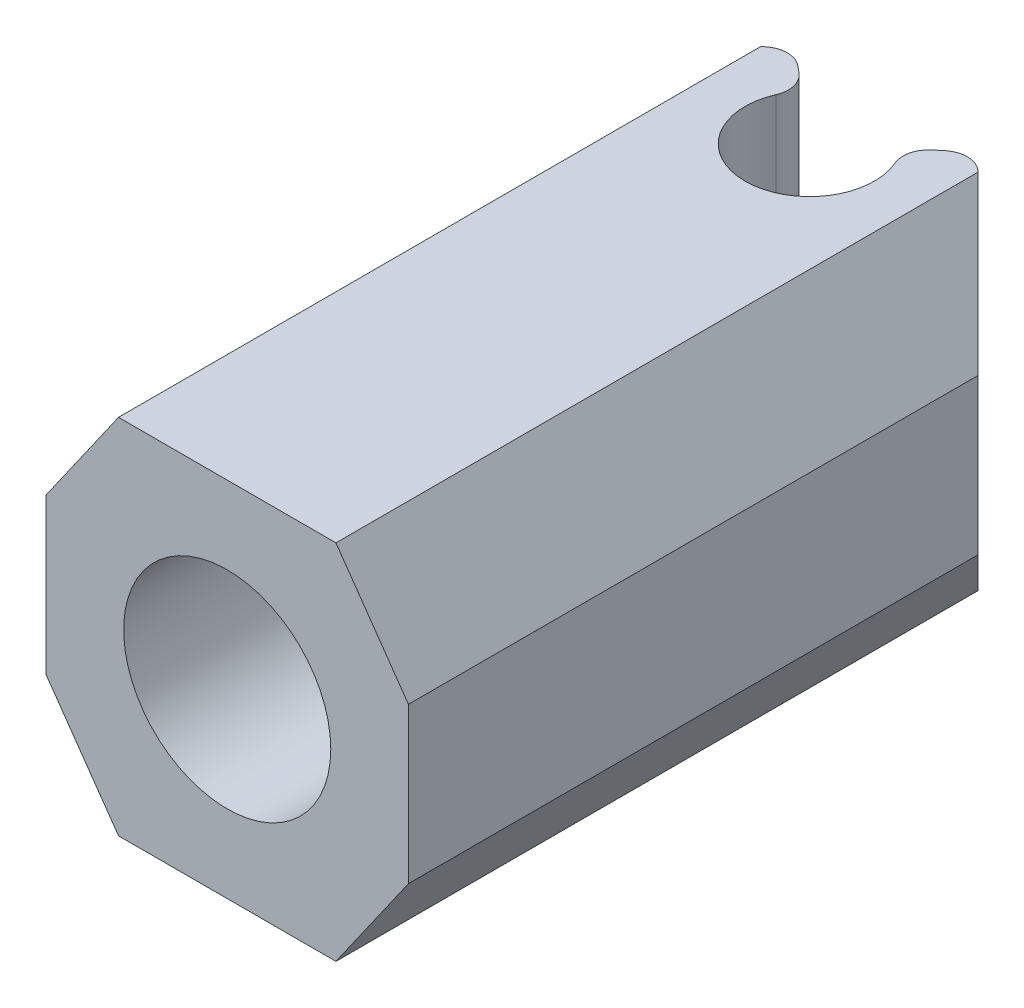
ISO-10303-21;
HEADER;
FILE_DESCRIPTION(('STEP AP214'),'2;1');
FILE_NAME('part.step','',(''),(''),'','','');
FILE_SCHEMA(('AUTOMOTIVE_DESIGN { 1 0 10303 214 1 1 1 1 }'));
ENDSEC;
DATA;
#1=APPLICATION_CONTEXT('core data for automotive mechanical design processes');
#2=APPLICATION_PROTOCOL_DEFINITION('international standard','automotive_design',2000,#1);
#3=PRODUCT_CONTEXT('',#1,'mechanical');
#4=PRODUCT('Part','Part','',(#3));
#5=PRODUCT_RELATED_PRODUCT_CATEGORY('part','',(#4));
#6=PRODUCT_DEFINITION_FORMATION('','',#4);
#7=PRODUCT_DEFINITION_CONTEXT('part definition',#1,'design');
#8=PRODUCT_DEFINITION('design','',#6,#7);
#9=PRODUCT_DEFINITION_SHAPE('','',#8);
#10=(LENGTH_UNIT() NAMED_UNIT(*) SI_UNIT(.MILLI.,.METRE.));
#11=(NAMED_UNIT(*) PLANE_ANGLE_UNIT() SI_UNIT($,.RADIAN.));
#12=(NAMED_UNIT(*) SI_UNIT($,.STERADIAN.) SOLID_ANGLE_UNIT());
#13=UNCERTAINTY_MEASURE_WITH_UNIT(LENGTH_MEASURE(1.E-05),#10,'distance_accuracy_value','');
#14=(GEOMETRIC_REPRESENTATION_CONTEXT(3) GLOBAL_UNCERTAINTY_ASSIGNED_CONTEXT((#13)) GLOBAL_UNIT_ASSIGNED_CONTEXT((#10,
#11,#12)) REPRESENTATION_CONTEXT('',''));
#15=CARTESIAN_POINT('',(0.,0.,0.));
#16=DIRECTION('',(0.,0.,1.));
#17=DIRECTION('',(1.,0.,0.));
#18=AXIS2_PLACEMENT_3D('',#15,#16,#17);
#19=CARTESIAN_POINT('',(0.,-3.,-15.));
#20=DIRECTION('',(0.,1.,0.));
#21=DIRECTION('',(0.,0.,1.));
#22=AXIS2_PLACEMENT_3D('',#19,#20,#21);
#23=PLANE('',#22);
#24=DIRECTION('',(-1.,0.,0.));
#25=VECTOR('',#24,1.);
#26=CARTESIAN_POINT('',(0.,-3.,-19.5));
#27=LINE('',#26,#25);
#28=CARTESIAN_POINT('',(0.343145750507606,-3.,-19.5));
#29=VERTEX_POINT('',#28);
#30=CARTESIAN_POINT('',(-0.343145750507613,-3.,-19.5));
#31=VERTEX_POINT('',#30);
#32=EDGE_CURVE('E251',#29,#31,#27,.T.);
#33=ORIENTED_EDGE('',*,*,#32,.T.);
#34=CARTESIAN_POINT('',(-0.343145750507613,-3.,-15.5));
#35=DIRECTION('',(0.,1.,0.));
#36=DIRECTION('',(0.,0.,1.));
#37=AXIS2_PLACEMENT_3D('',#34,#35,#36);
#38=CIRCLE('',#37,4.);
#39=CARTESIAN_POINT('',(-3.17157287525381,-3.,-18.3284271247462));
#40=VERTEX_POINT('',#39);
#41=EDGE_CURVE('E365',#31,#40,#38,.T.);
#42=ORIENTED_EDGE('',*,*,#41,.T.);
#43=DIRECTION('',(0.707106781186546,0.,-0.707106781186549));
#44=VECTOR('',#43,1.);
#45=CARTESIAN_POINT('',(-3.25,-3.,-18.25));
#46=LINE('',#45,#44);
#47=CARTESIAN_POINT('',(-6.49999999999998,-3.,-15.));
#48=VERTEX_POINT('',#47);
#49=EDGE_CURVE('E204',#40,#48,#46,.F.);
#50=ORIENTED_EDGE('',*,*,#49,.T.);
#51=DIRECTION('',(1.,0.,0.));
#52=VECTOR('',#51,1.);
#53=CARTESIAN_POINT('',(-7.,-3.,-15.));
#54=LINE('',#53,#52);
#55=CARTESIAN_POINT('',(-6.,-3.,-15.));
#56=VERTEX_POINT('',#55);
#57=EDGE_CURVE('E197',#48,#56,#54,.T.);
#58=ORIENTED_EDGE('',*,*,#57,.T.);
#59=CARTESIAN_POINT('',(0.,-3.,-15.));
#60=DIRECTION('',(0.,1.,0.));
#61=DIRECTION('',(0.,0.,1.));
#62=AXIS2_PLACEMENT_3D('',#59,#60,#61);
#63=CIRCLE('',#62,6.);
#64=CARTESIAN_POINT('',(6.,-3.,-15.));
#65=VERTEX_POINT('',#64);
#66=EDGE_CURVE('E203',#56,#65,#63,.T.);
#67=ORIENTED_EDGE('',*,*,#66,.T.);
#68=CARTESIAN_POINT('',(6.49999999999998,-3.,-15.));
#69=VERTEX_POINT('',#68);
#70=EDGE_CURVE('E208',#65,#69,#54,.T.);
#71=ORIENTED_EDGE('',*,*,#70,.T.);
#72=DIRECTION('',(0.707106781186546,0.,0.707106781186549));
#73=VECTOR('',#72,1.);
#74=CARTESIAN_POINT('',(3.25,-3.,-18.25));
#75=LINE('',#74,#73);
#76=CARTESIAN_POINT('',(3.1715728752538,-3.,-18.3284271247462));
#77=VERTEX_POINT('',#76);
#78=EDGE_CURVE('E274',#69,#77,#75,.F.);
#79=ORIENTED_EDGE('',*,*,#78,.T.);
#80=CARTESIAN_POINT('',(0.343145750507606,-3.,-15.5));
#81=DIRECTION('',(0.,1.,0.));
#82=DIRECTION('',(0.,0.,1.));
#83=AXIS2_PLACEMENT_3D('',#80,#81,#82);
#84=CIRCLE('',#83,4.);
#85=EDGE_CURVE('E363',#77,#29,#84,.T.);
#86=ORIENTED_EDGE('',*,*,#85,.T.);
#87=EDGE_LOOP('',(#33,#42,#50,#58,#67,#71,#79,#86));
#88=FACE_BOUND('',#87,.T.);
#89=CARTESIAN_POINT('',(0.,-3.,-15.));
#90=DIRECTION('',(0.,1.,0.));
#91=DIRECTION('',(0.,0.,1.));
#92=AXIS2_PLACEMENT_3D('',#89,#90,#91);
#93=CIRCLE('',#92,3.5);
#94=CARTESIAN_POINT('',(0.,-3.,-11.5));
#95=VERTEX_POINT('',#94);
#96=EDGE_CURVE('E407',#95,#95,#93,.T.);
#97=ORIENTED_EDGE('',*,*,#96,.F.);
#98=EDGE_LOOP('',(#97));
#99=FACE_BOUND('',#98,.T.);
#100=ADVANCED_FACE('F35',(#88,#99),#23,.T.);
#101=CARTESIAN_POINT('',(0.,0.,-19.5));
#102=DIRECTION('',(0.,0.,1.));
#103=DIRECTION('',(1.,0.,0.));
#104=AXIS2_PLACEMENT_3D('',#101,#102,#103);
#105=PLANE('',#104);
#106=DIRECTION('',(-1.,0.,0.));
#107=VECTOR('',#106,1.);
#108=CARTESIAN_POINT('',(7.,-7.,-19.5));
#109=LINE('',#108,#107);
#110=CARTESIAN_POINT('',(0.343145750507605,-7.,-19.5));
#111=VERTEX_POINT('',#110);
#112=CARTESIAN_POINT('',(-0.343145750507613,-7.,-19.5));
#113=VERTEX_POINT('',#112);
#114=EDGE_CURVE('E222',#111,#113,#109,.T.);
#115=ORIENTED_EDGE('',*,*,#114,.T.);
#116=DIRECTION('',(0.,-1.,0.));
#117=VECTOR('',#116,1.);
#118=CARTESIAN_POINT('',(-0.343145750507613,-3.,-19.5));
#119=LINE('',#118,#117);
#120=EDGE_CURVE('E360',#113,#31,#119,.F.);
#121=ORIENTED_EDGE('',*,*,#120,.T.);
#122=ORIENTED_EDGE('',*,*,#32,.F.);
#123=DIRECTION('',(0.,1.,0.));
#124=VECTOR('',#123,1.);
#125=CARTESIAN_POINT('',(0.343145750507606,-7.,-19.5));
#126=LINE('',#125,#124);
#127=EDGE_CURVE('E357',#29,#111,#126,.F.);
#128=ORIENTED_EDGE('',*,*,#127,.T.);
#129=EDGE_LOOP('',(#115,#121,#122,#128));
#130=FACE_BOUND('',#129,.T.);
#131=ADVANCED_FACE('F373',(#130),#105,.F.);
#132=CARTESIAN_POINT('',(-7.,7.,-7.49999999999999));
#133=DIRECTION('',(1.,0.,0.));
#134=DIRECTION('',(0.,0.,-1.));
#135=AXIS2_PLACEMENT_3D('',#132,#133,#134);
#136=PLANE('',#135);
#137=DIRECTION('',(0.,-1.,0.));
#138=VECTOR('',#137,1.);
#139=CARTESIAN_POINT('',(-7.,7.,-14.5));
#140=LINE('',#139,#138);
#141=CARTESIAN_POINT('',(-7.,2.99999999999998,-14.5));
#142=VERTEX_POINT('',#141);
#143=CARTESIAN_POINT('',(-7.,-2.99999999999998,-14.5));
#144=VERTEX_POINT('',#143);
#145=EDGE_CURVE('E279',#142,#144,#140,.T.);
#146=ORIENTED_EDGE('',*,*,#145,.T.);
#147=DIRECTION('',(0.,0.,1.));
#148=VECTOR('',#147,1.);
#149=CARTESIAN_POINT('',(-7.,-2.99999999999998,7.50000000000001));
#150=LINE('',#149,#148);
#151=CARTESIAN_POINT('',(-7.,-2.99999999999998,7.50000000000001));
#152=VERTEX_POINT('',#151);
#153=EDGE_CURVE('E316',#144,#152,#150,.T.);
#154=ORIENTED_EDGE('',*,*,#153,.T.);
#155=DIRECTION('',(0.,-1.,0.));
#156=VECTOR('',#155,1.);
#157=CARTESIAN_POINT('',(-7.,7.,7.50000000000001));
#158=LINE('',#157,#156);
#159=CARTESIAN_POINT('',(-7.,2.99999999999998,7.50000000000001));
#160=VERTEX_POINT('',#159);
#161=EDGE_CURVE('E248',#160,#152,#158,.T.);
#162=ORIENTED_EDGE('',*,*,#161,.F.);
#163=DIRECTION('',(0.,0.,-1.));
#164=VECTOR('',#163,1.);
#165=CARTESIAN_POINT('',(-7.,2.99999999999998,-7.49999999999999));
#166=LINE('',#165,#164);
#167=EDGE_CURVE('E297',#160,#142,#166,.T.);
#168=ORIENTED_EDGE('',*,*,#167,.T.);
#169=EDGE_LOOP('',(#146,#154,#162,#168));
#170=FACE_BOUND('',#169,.T.);
#171=ADVANCED_FACE('F432',(#170),#136,.F.);
#172=CARTESIAN_POINT('',(7.,7.,7.5));
#173=DIRECTION('',(0.,0.,-1.));
#174=DIRECTION('',(-1.,0.,0.));
#175=AXIS2_PLACEMENT_3D('',#172,#173,#174);
#176=PLANE('',#175);
#177=CARTESIAN_POINT('',(0.,0.,7.5));
#178=DIRECTION('',(0.,0.,1.));
#179=DIRECTION('',(1.,0.,0.));
#180=AXIS2_PLACEMENT_3D('',#177,#178,#179);
#181=CIRCLE('',#180,4.);
#182=CARTESIAN_POINT('',(4.,0.,7.5));
#183=VERTEX_POINT('',#182);
#184=EDGE_CURVE('E226',#183,#183,#181,.T.);
#185=ORIENTED_EDGE('',*,*,#184,.F.);
#186=EDGE_LOOP('',(#185));
#187=FACE_BOUND('',#186,.T.);
#188=DIRECTION('',(1.,0.,0.));
#189=VECTOR('',#188,1.);
#190=CARTESIAN_POINT('',(7.,-7.,7.5));
#191=LINE('',#190,#189);
#192=CARTESIAN_POINT('',(-4.19916984716116,-7.,7.50000000000001));
#193=VERTEX_POINT('',#192);
#194=CARTESIAN_POINT('',(4.19916984716116,-7.,7.5));
#195=VERTEX_POINT('',#194);
#196=EDGE_CURVE('E237',#193,#195,#191,.T.);
#197=ORIENTED_EDGE('',*,*,#196,.T.);
#198=DIRECTION('',(0.573576436351045,0.819152044288993,0.));
#199=VECTOR('',#198,1.);
#200=CARTESIAN_POINT('',(7.,-2.99999999999999,7.5));
#201=LINE('',#200,#199);
#202=CARTESIAN_POINT('',(7.,-2.99999999999999,7.5));
#203=VERTEX_POINT('',#202);
#204=EDGE_CURVE('E314',#195,#203,#201,.T.);
#205=ORIENTED_EDGE('',*,*,#204,.T.);
#206=DIRECTION('',(0.,-1.,0.));
#207=VECTOR('',#206,1.);
#208=CARTESIAN_POINT('',(7.,7.,7.5));
#209=LINE('',#208,#207);
#210=CARTESIAN_POINT('',(7.,2.99999999999998,7.5));
#211=VERTEX_POINT('',#210);
#212=EDGE_CURVE('E243',#211,#203,#209,.T.);
#213=ORIENTED_EDGE('',*,*,#212,.F.);
#214=DIRECTION('',(0.573576436351045,-0.819152044288993,0.));
#215=VECTOR('',#214,1.);
#216=CARTESIAN_POINT('',(4.19916984716116,7.,7.5));
#217=LINE('',#216,#215);
#218=CARTESIAN_POINT('',(4.19916984716116,7.,7.5));
#219=VERTEX_POINT('',#218);
#220=EDGE_CURVE('E295',#211,#219,#217,.F.);
#221=ORIENTED_EDGE('',*,*,#220,.T.);
#222=DIRECTION('',(1.,0.,0.));
#223=VECTOR('',#222,1.);
#224=CARTESIAN_POINT('',(7.,7.,7.5));
#225=LINE('',#224,#223);
#226=CARTESIAN_POINT('',(-4.19916984716116,7.,7.50000000000001));
#227=VERTEX_POINT('',#226);
#228=EDGE_CURVE('E240',#227,#219,#225,.T.);
#229=ORIENTED_EDGE('',*,*,#228,.F.);
#230=DIRECTION('',(0.573576436351044,0.819152044288993,0.));
#231=VECTOR('',#230,1.);
#232=CARTESIAN_POINT('',(-4.19916984716116,7.,7.50000000000001));
#233=LINE('',#232,#231);
#234=EDGE_CURVE('E293',#227,#160,#233,.F.);
#235=ORIENTED_EDGE('',*,*,#234,.T.);
#236=ORIENTED_EDGE('',*,*,#161,.T.);
#237=DIRECTION('',(0.573576436351045,-0.819152044288993,0.));
#238=VECTOR('',#237,1.);
#239=CARTESIAN_POINT('',(-7.,-2.99999999999998,7.50000000000001));
#240=LINE('',#239,#238);
#241=EDGE_CURVE('E312',#152,#193,#240,.T.);
#242=ORIENTED_EDGE('',*,*,#241,.T.);
#243=EDGE_LOOP('',(#197,#205,#213,#221,#229,#235,#236,#242));
#244=FACE_BOUND('',#243,.T.);
#245=ADVANCED_FACE('F457',(#187,#244),#176,.F.);
#246=CARTESIAN_POINT('',(7.,7.,-7.5));
#247=DIRECTION('',(-1.,0.,0.));
#248=DIRECTION('',(0.,0.,1.));
#249=AXIS2_PLACEMENT_3D('',#246,#247,#248);
#250=PLANE('',#249);
#251=ORIENTED_EDGE('',*,*,#212,.T.);
#252=DIRECTION('',(0.,0.,-1.));
#253=VECTOR('',#252,1.);
#254=CARTESIAN_POINT('',(7.,-2.99999999999999,-14.5));
#255=LINE('',#254,#253);
#256=CARTESIAN_POINT('',(7.,-2.99999999999999,-14.5));
#257=VERTEX_POINT('',#256);
#258=EDGE_CURVE('E302',#203,#257,#255,.T.);
#259=ORIENTED_EDGE('',*,*,#258,.T.);
#260=DIRECTION('',(0.,1.,0.));
#261=VECTOR('',#260,1.);
#262=CARTESIAN_POINT('',(7.,7.,-14.5));
#263=LINE('',#262,#261);
#264=CARTESIAN_POINT('',(7.,2.99999999999998,-14.5));
#265=VERTEX_POINT('',#264);
#266=EDGE_CURVE('E259',#257,#265,#263,.T.);
#267=ORIENTED_EDGE('',*,*,#266,.T.);
#268=DIRECTION('',(0.,0.,1.));
#269=VECTOR('',#268,1.);
#270=CARTESIAN_POINT('',(7.,2.99999999999998,-7.5));
#271=LINE('',#270,#269);
#272=EDGE_CURVE('E291',#265,#211,#271,.T.);
#273=ORIENTED_EDGE('',*,*,#272,.T.);
#274=EDGE_LOOP('',(#251,#259,#267,#273));
#275=FACE_BOUND('',#274,.T.);
#276=ADVANCED_FACE('F451',(#275),#250,.F.);
#277=CARTESIAN_POINT('',(0.,7.,0.));
#278=DIRECTION('',(0.,-1.,0.));
#279=DIRECTION('',(0.,0.,-1.));
#280=AXIS2_PLACEMENT_3D('',#277,#278,#279);
#281=PLANE('',#280);
#282=DIRECTION('',(0.766044443118979,0.,0.642787609686538));
#283=VECTOR('',#282,1.);
#284=CARTESIAN_POINT('',(-11.7512907121979,7.,-24.8605037024622));
#285=LINE('',#284,#283);
#286=CARTESIAN_POINT('',(-2.83238775254652,7.,-17.3766555185128));
#287=VERTEX_POINT('',#286);
#288=CARTESIAN_POINT('',(-2.56939117290001,7.,-17.1559751855305));
#289=VERTEX_POINT('',#288);
#290=EDGE_CURVE('E547',#287,#289,#285,.T.);
#291=ORIENTED_EDGE('',*,*,#290,.F.);
#292=CARTESIAN_POINT('',(-3.47517536223306,7.,-16.6106110753938));
#293=DIRECTION('',(0.,-1.,0.));
#294=DIRECTION('',(0.,0.,-1.));
#295=AXIS2_PLACEMENT_3D('',#292,#293,#294);
#296=CIRCLE('',#295,1.);
#297=CARTESIAN_POINT('',(-4.1822821434196,7.,-17.3177178565804));
#298=VERTEX_POINT('',#297);
#299=EDGE_CURVE('E332',#287,#298,#296,.F.);
#300=ORIENTED_EDGE('',*,*,#299,.T.);
#301=DIRECTION('',(0.707106781186546,0.,-0.707106781186549));
#302=VECTOR('',#301,1.);
#303=CARTESIAN_POINT('',(-2.,7.,-19.5));
#304=LINE('',#303,#302);
#305=CARTESIAN_POINT('',(-4.19916984716116,7.,-17.3008301528388));
#306=VERTEX_POINT('',#305);
#307=EDGE_CURVE('E261',#298,#306,#304,.F.);
#308=ORIENTED_EDGE('',*,*,#307,.T.);
#309=DIRECTION('',(0.,0.,1.));
#310=VECTOR('',#309,1.);
#311=CARTESIAN_POINT('',(-4.19916984716116,7.,0.));
#312=LINE('',#311,#310);
#313=EDGE_CURVE('E282',#306,#227,#312,.T.);
#314=ORIENTED_EDGE('',*,*,#313,.T.);
#315=ORIENTED_EDGE('',*,*,#228,.T.);
#316=DIRECTION('',(0.,0.,-1.));
#317=VECTOR('',#316,1.);
#318=CARTESIAN_POINT('',(4.19916984716116,7.,0.));
#319=LINE('',#318,#317);
#320=CARTESIAN_POINT('',(4.19916984716116,7.,-17.3008301528388));
#321=VERTEX_POINT('',#320);
#322=EDGE_CURVE('E285',#219,#321,#319,.T.);
#323=ORIENTED_EDGE('',*,*,#322,.T.);
#324=DIRECTION('',(0.707106781186546,0.,0.707106781186549));
#325=VECTOR('',#324,1.);
#326=CARTESIAN_POINT('',(1.99999999999999,7.,-19.5));
#327=LINE('',#326,#325);
#328=CARTESIAN_POINT('',(4.1822821434196,7.,-17.3177178565804));
#329=VERTEX_POINT('',#328);
#330=EDGE_CURVE('E263',#321,#329,#327,.F.);
#331=ORIENTED_EDGE('',*,*,#330,.T.);
#332=CARTESIAN_POINT('',(3.47517536223306,7.,-16.6106110753938));
#333=DIRECTION('',(0.,-1.,0.));
#334=DIRECTION('',(0.,0.,-1.));
#335=AXIS2_PLACEMENT_3D('',#332,#333,#334);
#336=CIRCLE('',#335,1.);
#337=CARTESIAN_POINT('',(2.83238775254652,7.,-17.3766555185128));
#338=VERTEX_POINT('',#337);
#339=EDGE_CURVE('E330',#329,#338,#336,.F.);
#340=ORIENTED_EDGE('',*,*,#339,.T.);
#341=DIRECTION('',(0.766044443118979,0.,-0.642787609686538));
#342=VECTOR('',#341,1.);
#343=CARTESIAN_POINT('',(0.,7.,-15.));
#344=LINE('',#343,#342);
#345=CARTESIAN_POINT('',(2.56939117290001,7.,-17.1559751855305));
#346=VERTEX_POINT('',#345);
#347=EDGE_CURVE('E545',#346,#338,#344,.T.);
#348=ORIENTED_EDGE('',*,*,#347,.F.);
#349=CARTESIAN_POINT('',(3.21217878258655,7.,-16.3899307424116));
#350=DIRECTION('',(0.,-1.,0.));
#351=DIRECTION('',(0.,0.,-1.));
#352=AXIS2_PLACEMENT_3D('',#349,#350,#351);
#353=CIRCLE('',#352,1.);
#354=CARTESIAN_POINT('',(2.29441341613325,7.,-15.9928076731511));
#355=VERTEX_POINT('',#354);
#356=EDGE_CURVE('E326',#346,#355,#353,.F.);
#357=ORIENTED_EDGE('',*,*,#356,.T.);
#358=CARTESIAN_POINT('',(0.,7.,-15.));
#359=DIRECTION('',(0.,1.,0.));
#360=DIRECTION('',(0.,0.,1.));
#361=AXIS2_PLACEMENT_3D('',#358,#359,#360);
#362=CIRCLE('',#361,2.5);
#363=CARTESIAN_POINT('',(-2.29441341613325,7.,-15.9928076731511));
#364=VERTEX_POINT('',#363);
#365=EDGE_CURVE('E388',#364,#355,#362,.T.);
#366=ORIENTED_EDGE('',*,*,#365,.F.);
#367=CARTESIAN_POINT('',(-3.21217878258655,7.,-16.3899307424116));
#368=DIRECTION('',(0.,-1.,0.));
#369=DIRECTION('',(0.,0.,-1.));
#370=AXIS2_PLACEMENT_3D('',#367,#368,#369);
#371=CIRCLE('',#370,1.);
#372=EDGE_CURVE('E328',#364,#289,#371,.F.);
#373=ORIENTED_EDGE('',*,*,#372,.T.);
#374=EDGE_LOOP('',(#291,#300,#308,#314,#315,#323,#331,#340,#348,#357,#366,#373));
#375=FACE_BOUND('',#374,.T.);
#376=ADVANCED_FACE('F448',(#375),#281,.F.);
#377=CARTESIAN_POINT('',(0.,-7.,0.));
#378=DIRECTION('',(0.,-1.,0.));
#379=DIRECTION('',(0.,0.,-1.));
#380=AXIS2_PLACEMENT_3D('',#377,#378,#379);
#381=PLANE('',#380);
#382=CARTESIAN_POINT('',(0.,-7.,-15.));
#383=DIRECTION('',(0.,1.,0.));
#384=DIRECTION('',(0.,0.,1.));
#385=AXIS2_PLACEMENT_3D('',#382,#383,#384);
#386=CIRCLE('',#385,2.5);
#387=CARTESIAN_POINT('',(0.,-7.,-12.5));
#388=VERTEX_POINT('',#387);
#389=EDGE_CURVE('E231',#388,#388,#386,.T.);
#390=ORIENTED_EDGE('',*,*,#389,.T.);
#391=EDGE_LOOP('',(#390));
#392=FACE_BOUND('',#391,.T.);
#393=DIRECTION('',(-0.707106781186546,0.,0.707106781186549));
#394=VECTOR('',#393,1.);
#395=CARTESIAN_POINT('',(-10.75,-7.,-10.75));
#396=LINE('',#395,#394);
#397=CARTESIAN_POINT('',(-4.19916984716116,-7.,-17.3008301528388));
#398=VERTEX_POINT('',#397);
#399=CARTESIAN_POINT('',(-3.17157287525381,-7.,-18.3284271247462));
#400=VERTEX_POINT('',#399);
#401=EDGE_CURVE('E253',#398,#400,#396,.F.);
#402=ORIENTED_EDGE('',*,*,#401,.T.);
#403=CARTESIAN_POINT('',(-0.343145750507613,-7.,-15.5));
#404=DIRECTION('',(0.,-1.,0.));
#405=DIRECTION('',(0.,0.,-1.));
#406=AXIS2_PLACEMENT_3D('',#403,#404,#405);
#407=CIRCLE('',#406,4.);
#408=EDGE_CURVE('E43',#400,#113,#407,.T.);
#409=ORIENTED_EDGE('',*,*,#408,.T.);
#410=ORIENTED_EDGE('',*,*,#114,.F.);
#411=CARTESIAN_POINT('',(0.343145750507606,-7.,-15.5));
#412=DIRECTION('',(0.,-1.,0.));
#413=DIRECTION('',(0.,0.,-1.));
#414=AXIS2_PLACEMENT_3D('',#411,#412,#413);
#415=CIRCLE('',#414,4.);
#416=CARTESIAN_POINT('',(3.1715728752538,-7.,-18.3284271247462));
#417=VERTEX_POINT('',#416);
#418=EDGE_CURVE('E50',#111,#417,#415,.T.);
#419=ORIENTED_EDGE('',*,*,#418,.T.);
#420=DIRECTION('',(-0.707106781186546,0.,-0.707106781186549));
#421=VECTOR('',#420,1.);
#422=CARTESIAN_POINT('',(10.75,-7.,-10.75));
#423=LINE('',#422,#421);
#424=CARTESIAN_POINT('',(4.19916984716115,-7.,-17.3008301528388));
#425=VERTEX_POINT('',#424);
#426=EDGE_CURVE('E257',#417,#425,#423,.F.);
#427=ORIENTED_EDGE('',*,*,#426,.T.);
#428=DIRECTION('',(0.,0.,1.));
#429=VECTOR('',#428,1.);
#430=CARTESIAN_POINT('',(4.19916984716116,-7.,7.5));
#431=LINE('',#430,#429);
#432=EDGE_CURVE('E310',#425,#195,#431,.T.);
#433=ORIENTED_EDGE('',*,*,#432,.T.);
#434=ORIENTED_EDGE('',*,*,#196,.F.);
#435=DIRECTION('',(0.,0.,-1.));
#436=VECTOR('',#435,1.);
#437=CARTESIAN_POINT('',(-4.19916984716116,-7.,-14.5));
#438=LINE('',#437,#436);
#439=EDGE_CURVE('E308',#193,#398,#438,.T.);
#440=ORIENTED_EDGE('',*,*,#439,.T.);
#441=EDGE_LOOP('',(#402,#409,#410,#419,#427,#433,#434,#440));
#442=FACE_BOUND('',#441,.T.);
#443=ADVANCED_FACE('F369',(#392,#442),#381,.T.);
#444=CARTESIAN_POINT('',(0.,0.,-7.5));
#445=DIRECTION('',(0.,0.,1.));
#446=DIRECTION('',(1.,0.,0.));
#447=AXIS2_PLACEMENT_3D('',#444,#445,#446);
#448=CYLINDRICAL_SURFACE('',#447,4.);
#449=CARTESIAN_POINT('',(0.,0.,-7.5));
#450=DIRECTION('',(0.,0.,1.));
#451=DIRECTION('',(1.,0.,0.));
#452=AXIS2_PLACEMENT_3D('',#449,#450,#451);
#453=CIRCLE('',#452,4.);
#454=CARTESIAN_POINT('',(4.,0.,-7.5));
#455=VERTEX_POINT('',#454);
#456=EDGE_CURVE('E234',#455,#455,#453,.T.);
#457=ORIENTED_EDGE('',*,*,#456,.F.);
#458=EDGE_LOOP('',(#457));
#459=FACE_BOUND('',#458,.T.);
#460=ORIENTED_EDGE('',*,*,#184,.T.);
#461=EDGE_LOOP('',(#460));
#462=FACE_BOUND('',#461,.T.);
#463=ADVANCED_FACE('F443',(#459,#462),#448,.F.);
#464=CARTESIAN_POINT('',(0.,0.,-7.49999999999999));
#465=DIRECTION('',(0.,0.,1.));
#466=DIRECTION('',(1.,0.,0.));
#467=AXIS2_PLACEMENT_3D('',#464,#465,#466);
#468=PLANE('',#467);
#469=ORIENTED_EDGE('',*,*,#456,.T.);
#470=EDGE_LOOP('',(#469));
#471=FACE_BOUND('',#470,.T.);
#472=ADVANCED_FACE('F439',(#471),#468,.T.);
#473=CARTESIAN_POINT('',(0.,-3.,-15.));
#474=DIRECTION('',(0.,1.,0.));
#475=DIRECTION('',(0.,0.,1.));
#476=AXIS2_PLACEMENT_3D('',#473,#474,#475);
#477=CYLINDRICAL_SURFACE('',#476,6.);
#478=CARTESIAN_POINT('',(0.,3.,-15.));
#479=DIRECTION('',(0.,1.,0.));
#480=DIRECTION('',(0.,0.,1.));
#481=AXIS2_PLACEMENT_3D('',#478,#479,#480);
#482=CIRCLE('',#481,6.);
#483=CARTESIAN_POINT('',(-6.,3.,-15.));
#484=VERTEX_POINT('',#483);
#485=CARTESIAN_POINT('',(6.,3.,-15.));
#486=VERTEX_POINT('',#485);
#487=EDGE_CURVE('E223',#484,#486,#482,.T.);
#488=ORIENTED_EDGE('',*,*,#487,.T.);
#489=DIRECTION('',(0.,1.,0.));
#490=VECTOR('',#489,1.);
#491=CARTESIAN_POINT('',(6.,-3.,-15.));
#492=LINE('',#491,#490);
#493=EDGE_CURVE('E217',#486,#65,#492,.F.);
#494=ORIENTED_EDGE('',*,*,#493,.T.);
#495=ORIENTED_EDGE('',*,*,#66,.F.);
#496=DIRECTION('',(0.,1.,0.));
#497=VECTOR('',#496,1.);
#498=CARTESIAN_POINT('',(-6.,-3.,-15.));
#499=LINE('',#498,#497);
#500=EDGE_CURVE('E207',#56,#484,#499,.T.);
#501=ORIENTED_EDGE('',*,*,#500,.T.);
#502=EDGE_LOOP('',(#488,#494,#495,#501));
#503=FACE_BOUND('',#502,.T.);
#504=ADVANCED_FACE('F220',(#503),#477,.F.);
#505=CARTESIAN_POINT('',(0.,3.,-15.));
#506=DIRECTION('',(0.,1.,0.));
#507=DIRECTION('',(0.,0.,1.));
#508=AXIS2_PLACEMENT_3D('',#505,#506,#507);
#509=PLANE('',#508);
#510=DIRECTION('',(-0.707106781186546,0.,0.707106781186549));
#511=VECTOR('',#510,1.);
#512=CARTESIAN_POINT('',(-2.,3.,-19.5));
#513=LINE('',#512,#511);
#514=CARTESIAN_POINT('',(-6.49999999999998,3.,-15.));
#515=VERTEX_POINT('',#514);
#516=CARTESIAN_POINT('',(-4.1822821434196,3.,-17.3177178565804));
#517=VERTEX_POINT('',#516);
#518=EDGE_CURVE('E266',#515,#517,#513,.F.);
#519=ORIENTED_EDGE('',*,*,#518,.T.);
#520=CARTESIAN_POINT('',(-3.47517536223306,3.,-16.6106110753938));
#521=DIRECTION('',(0.,1.,0.));
#522=DIRECTION('',(0.,0.,1.));
#523=AXIS2_PLACEMENT_3D('',#520,#521,#522);
#524=CIRCLE('',#523,1.);
#525=CARTESIAN_POINT('',(-2.83238775254652,3.,-17.3766555185128));
#526=VERTEX_POINT('',#525);
#527=EDGE_CURVE('E342',#517,#526,#524,.F.);
#528=ORIENTED_EDGE('',*,*,#527,.T.);
#529=DIRECTION('',(0.766044443118979,0.,0.642787609686538));
#530=VECTOR('',#529,1.);
#531=CARTESIAN_POINT('',(0.,3.,-15.));
#532=LINE('',#531,#530);
#533=CARTESIAN_POINT('',(-2.56939117290001,3.,-17.1559751855305));
#534=VERTEX_POINT('',#533);
#535=EDGE_CURVE('E412',#526,#534,#532,.T.);
#536=ORIENTED_EDGE('',*,*,#535,.T.);
#537=CARTESIAN_POINT('',(-3.21217878258655,3.,-16.3899307424116));
#538=DIRECTION('',(0.,1.,0.));
#539=DIRECTION('',(0.,0.,1.));
#540=AXIS2_PLACEMENT_3D('',#537,#538,#539);
#541=CIRCLE('',#540,1.);
#542=CARTESIAN_POINT('',(-2.29441341613325,3.,-15.9928076731511));
#543=VERTEX_POINT('',#542);
#544=EDGE_CURVE('E338',#534,#543,#541,.F.);
#545=ORIENTED_EDGE('',*,*,#544,.T.);
#546=CARTESIAN_POINT('',(0.,3.,-15.));
#547=DIRECTION('',(0.,1.,0.));
#548=DIRECTION('',(0.,0.,1.));
#549=AXIS2_PLACEMENT_3D('',#546,#547,#548);
#550=CIRCLE('',#549,2.5);
#551=CARTESIAN_POINT('',(2.29441341613325,3.,-15.9928076731511));
#552=VERTEX_POINT('',#551);
#553=EDGE_CURVE('E228',#543,#552,#550,.T.);
#554=ORIENTED_EDGE('',*,*,#553,.T.);
#555=CARTESIAN_POINT('',(3.21217878258655,3.,-16.3899307424116));
#556=DIRECTION('',(0.,1.,0.));
#557=DIRECTION('',(0.,0.,1.));
#558=AXIS2_PLACEMENT_3D('',#555,#556,#557);
#559=CIRCLE('',#558,1.);
#560=CARTESIAN_POINT('',(2.56939117290001,3.,-17.1559751855305));
#561=VERTEX_POINT('',#560);
#562=EDGE_CURVE('E336',#552,#561,#559,.F.);
#563=ORIENTED_EDGE('',*,*,#562,.T.);
#564=DIRECTION('',(0.766044443118979,0.,-0.642787609686538));
#565=VECTOR('',#564,1.);
#566=CARTESIAN_POINT('',(0.,3.,-15.));
#567=LINE('',#566,#565);
#568=CARTESIAN_POINT('',(2.83238775254652,3.,-17.3766555185128));
#569=VERTEX_POINT('',#568);
#570=EDGE_CURVE('E408',#561,#569,#567,.T.);
#571=ORIENTED_EDGE('',*,*,#570,.T.);
#572=CARTESIAN_POINT('',(3.47517536223306,3.,-16.6106110753938));
#573=DIRECTION('',(0.,1.,0.));
#574=DIRECTION('',(0.,0.,1.));
#575=AXIS2_PLACEMENT_3D('',#572,#573,#574);
#576=CIRCLE('',#575,1.);
#577=CARTESIAN_POINT('',(4.1822821434196,3.,-17.3177178565804));
#578=VERTEX_POINT('',#577);
#579=EDGE_CURVE('E340',#569,#578,#576,.F.);
#580=ORIENTED_EDGE('',*,*,#579,.T.);
#581=DIRECTION('',(-0.707106781186546,0.,-0.707106781186549));
#582=VECTOR('',#581,1.);
#583=CARTESIAN_POINT('',(1.99999999999999,3.,-19.5));
#584=LINE('',#583,#582);
#585=CARTESIAN_POINT('',(6.49999999999998,3.,-15.));
#586=VERTEX_POINT('',#585);
#587=EDGE_CURVE('E269',#578,#586,#584,.F.);
#588=ORIENTED_EDGE('',*,*,#587,.T.);
#589=DIRECTION('',(1.,0.,0.));
#590=VECTOR('',#589,1.);
#591=CARTESIAN_POINT('',(-7.,3.,-15.));
#592=LINE('',#591,#590);
#593=EDGE_CURVE('E382',#486,#586,#592,.T.);
#594=ORIENTED_EDGE('',*,*,#593,.F.);
#595=ORIENTED_EDGE('',*,*,#487,.F.);
#596=EDGE_CURVE('E213',#515,#484,#592,.T.);
#597=ORIENTED_EDGE('',*,*,#596,.F.);
#598=EDGE_LOOP('',(#519,#528,#536,#545,#554,#563,#571,#580,#588,#594,#595,#597));
#599=FACE_BOUND('',#598,.T.);
#600=ADVANCED_FACE('F380',(#599),#509,.F.);
#601=CARTESIAN_POINT('',(0.,-7.,-15.));
#602=DIRECTION('',(0.,1.,0.));
#603=DIRECTION('',(0.,0.,1.));
#604=AXIS2_PLACEMENT_3D('',#601,#602,#603);
#605=CYLINDRICAL_SURFACE('',#604,2.5);
#606=ORIENTED_EDGE('',*,*,#553,.F.);
#607=DIRECTION('',(0.,1.,0.));
#608=VECTOR('',#607,1.);
#609=CARTESIAN_POINT('',(-2.29441341613325,-7.,-15.9928076731511));
#610=LINE('',#609,#608);
#611=EDGE_CURVE('E354',#543,#364,#610,.T.);
#612=ORIENTED_EDGE('',*,*,#611,.T.);
#613=ORIENTED_EDGE('',*,*,#365,.T.);
#614=DIRECTION('',(0.,1.,0.));
#615=VECTOR('',#614,1.);
#616=CARTESIAN_POINT('',(2.29441341613325,-7.,-15.9928076731511));
#617=LINE('',#616,#615);
#618=EDGE_CURVE('E351',#355,#552,#617,.F.);
#619=ORIENTED_EDGE('',*,*,#618,.T.);
#620=EDGE_LOOP('',(#606,#612,#613,#619));
#621=FACE_BOUND('',#620,.T.);
#622=ADVANCED_FACE('F401',(#621),#605,.F.);
#623=ORIENTED_EDGE('',*,*,#389,.F.);
#624=EDGE_LOOP('',(#623));
#625=FACE_BOUND('',#624,.T.);
#626=CARTESIAN_POINT('',(0.,-2.,-15.));
#627=DIRECTION('',(0.,1.,0.));
#628=DIRECTION('',(0.,0.,1.));
#629=AXIS2_PLACEMENT_3D('',#626,#627,#628);
#630=CIRCLE('',#629,2.5);
#631=CARTESIAN_POINT('',(0.,-2.,-12.5));
#632=VERTEX_POINT('',#631);
#633=EDGE_CURVE('E405',#632,#632,#630,.T.);
#634=ORIENTED_EDGE('',*,*,#633,.T.);
#635=EDGE_LOOP('',(#634));
#636=FACE_BOUND('',#635,.T.);
#637=ADVANCED_FACE('F397',(#625,#636),#605,.F.);
#638=CARTESIAN_POINT('',(-7.,-3.,-15.));
#639=DIRECTION('',(0.,0.,1.));
#640=DIRECTION('',(1.,0.,0.));
#641=AXIS2_PLACEMENT_3D('',#638,#639,#640);
#642=PLANE('',#641);
#643=ORIENTED_EDGE('',*,*,#593,.T.);
#644=DIRECTION('',(0.,1.,0.));
#645=VECTOR('',#644,1.);
#646=CARTESIAN_POINT('',(6.49999999999998,0.,-15.));
#647=LINE('',#646,#645);
#648=EDGE_CURVE('E271',#586,#69,#647,.F.);
#649=ORIENTED_EDGE('',*,*,#648,.T.);
#650=ORIENTED_EDGE('',*,*,#70,.F.);
#651=ORIENTED_EDGE('',*,*,#493,.F.);
#652=EDGE_LOOP('',(#643,#649,#650,#651));
#653=FACE_BOUND('',#652,.T.);
#654=ADVANCED_FACE('F400',(#653),#642,.F.);
#655=ORIENTED_EDGE('',*,*,#57,.F.);
#656=DIRECTION('',(0.,-1.,0.));
#657=VECTOR('',#656,1.);
#658=CARTESIAN_POINT('',(-6.49999999999998,0.,-15.));
#659=LINE('',#658,#657);
#660=EDGE_CURVE('E277',#48,#515,#659,.F.);
#661=ORIENTED_EDGE('',*,*,#660,.T.);
#662=ORIENTED_EDGE('',*,*,#596,.T.);
#663=ORIENTED_EDGE('',*,*,#500,.F.);
#664=EDGE_LOOP('',(#655,#661,#662,#663));
#665=FACE_BOUND('',#664,.T.);
#666=ADVANCED_FACE('F211',(#665),#642,.F.);
#667=CARTESIAN_POINT('',(1.99999999999999,0.,-19.5));
#668=DIRECTION('',(-0.707106781186549,0.,0.707106781186546));
#669=DIRECTION('',(0.,-1.,0.));
#670=AXIS2_PLACEMENT_3D('',#667,#668,#669);
#671=PLANE('',#670);
#672=ORIENTED_EDGE('',*,*,#426,.F.);
#673=DIRECTION('',(0.,-1.,0.));
#674=VECTOR('',#673,1.);
#675=CARTESIAN_POINT('',(3.1715728752538,-3.,-18.3284271247462));
#676=LINE('',#675,#674);
#677=EDGE_CURVE('E11',#417,#77,#676,.F.);
#678=ORIENTED_EDGE('',*,*,#677,.T.);
#679=ORIENTED_EDGE('',*,*,#78,.F.);
#680=ORIENTED_EDGE('',*,*,#648,.F.);
#681=ORIENTED_EDGE('',*,*,#587,.F.);
#682=DIRECTION('',(0.,-1.,0.));
#683=VECTOR('',#682,1.);
#684=CARTESIAN_POINT('',(4.1822821434196,7.,-17.3177178565804));
#685=LINE('',#684,#683);
#686=EDGE_CURVE('E349',#578,#329,#685,.F.);
#687=ORIENTED_EDGE('',*,*,#686,.T.);
#688=ORIENTED_EDGE('',*,*,#330,.F.);
#689=DIRECTION('',(0.497542812164522,-0.710564775461631,0.497542812164523));
#690=VECTOR('',#689,1.);
#691=CARTESIAN_POINT('',(5.58512069045887,5.02065706570181,-15.9148793095411));
#692=LINE('',#691,#690);
#693=EDGE_CURVE('E288',#321,#265,#692,.T.);
#694=ORIENTED_EDGE('',*,*,#693,.T.);
#695=ORIENTED_EDGE('',*,*,#266,.F.);
#696=DIRECTION('',(0.497542812164522,0.71056477546163,0.497542812164524));
#697=VECTOR('',#696,1.);
#698=CARTESIAN_POINT('',(5.58512069045887,-5.02065706570181,-15.9148793095411));
#699=LINE('',#698,#697);
#700=EDGE_CURVE('E305',#257,#425,#699,.F.);
#701=ORIENTED_EDGE('',*,*,#700,.T.);
#702=EDGE_LOOP('',(#672,#678,#679,#680,#681,#687,#688,#694,#695,#701));
#703=FACE_BOUND('',#702,.T.);
#704=ADVANCED_FACE('F465',(#703),#671,.F.);
#705=CARTESIAN_POINT('',(-2.,0.,-19.5));
#706=DIRECTION('',(0.707106781186549,0.,0.707106781186546));
#707=DIRECTION('',(0.,1.,0.));
#708=AXIS2_PLACEMENT_3D('',#705,#706,#707);
#709=PLANE('',#708);
#710=ORIENTED_EDGE('',*,*,#49,.F.);
#711=DIRECTION('',(0.,1.,0.));
#712=VECTOR('',#711,1.);
#713=CARTESIAN_POINT('',(-3.17157287525381,-7.,-18.3284271247462));
#714=LINE('',#713,#712);
#715=EDGE_CURVE('E58',#40,#400,#714,.F.);
#716=ORIENTED_EDGE('',*,*,#715,.T.);
#717=ORIENTED_EDGE('',*,*,#401,.F.);
#718=DIRECTION('',(0.497542812164522,-0.710564775461631,-0.497542812164523));
#719=VECTOR('',#718,1.);
#720=CARTESIAN_POINT('',(-5.58512069045887,-5.02065706570181,-15.9148793095411));
#721=LINE('',#720,#719);
#722=EDGE_CURVE('E319',#398,#144,#721,.F.);
#723=ORIENTED_EDGE('',*,*,#722,.T.);
#724=ORIENTED_EDGE('',*,*,#145,.F.);
#725=DIRECTION('',(0.497542812164521,0.710564775461631,-0.497542812164523));
#726=VECTOR('',#725,1.);
#727=CARTESIAN_POINT('',(-5.58512069045888,5.02065706570181,-15.9148793095411));
#728=LINE('',#727,#726);
#729=EDGE_CURVE('E299',#142,#306,#728,.T.);
#730=ORIENTED_EDGE('',*,*,#729,.T.);
#731=ORIENTED_EDGE('',*,*,#307,.F.);
#732=DIRECTION('',(0.,1.,0.));
#733=VECTOR('',#732,1.);
#734=CARTESIAN_POINT('',(-4.1822821434196,3.,-17.3177178565804));
#735=LINE('',#734,#733);
#736=EDGE_CURVE('E334',#298,#517,#735,.F.);
#737=ORIENTED_EDGE('',*,*,#736,.T.);
#738=ORIENTED_EDGE('',*,*,#518,.F.);
#739=ORIENTED_EDGE('',*,*,#660,.F.);
#740=EDGE_LOOP('',(#710,#716,#717,#723,#724,#730,#731,#737,#738,#739));
#741=FACE_BOUND('',#740,.T.);
#742=ADVANCED_FACE('F377',(#741),#709,.F.);
#743=CARTESIAN_POINT('',(0.,-2.,-15.));
#744=DIRECTION('',(0.,1.,0.));
#745=DIRECTION('',(0.,0.,1.));
#746=AXIS2_PLACEMENT_3D('',#743,#744,#745);
#747=PLANE('',#746);
#748=CARTESIAN_POINT('',(0.,-2.,-15.));
#749=DIRECTION('',(0.,1.,0.));
#750=DIRECTION('',(0.,0.,1.));
#751=AXIS2_PLACEMENT_3D('',#748,#749,#750);
#752=CIRCLE('',#751,3.5);
#753=CARTESIAN_POINT('',(0.,-2.,-11.5));
#754=VERTEX_POINT('',#753);
#755=EDGE_CURVE('E385',#754,#754,#752,.T.);
#756=ORIENTED_EDGE('',*,*,#755,.T.);
#757=EDGE_LOOP('',(#756));
#758=FACE_BOUND('',#757,.T.);
#759=ORIENTED_EDGE('',*,*,#633,.F.);
#760=EDGE_LOOP('',(#759));
#761=FACE_BOUND('',#760,.T.);
#762=ADVANCED_FACE('F419',(#758,#761),#747,.T.);
#763=CARTESIAN_POINT('',(0.,-2.,-15.));
#764=DIRECTION('',(0.,-1.,0.));
#765=DIRECTION('',(0.,0.,-1.));
#766=AXIS2_PLACEMENT_3D('',#763,#764,#765);
#767=CYLINDRICAL_SURFACE('',#766,3.5);
#768=ORIENTED_EDGE('',*,*,#755,.F.);
#769=EDGE_LOOP('',(#768));
#770=FACE_BOUND('',#769,.T.);
#771=ORIENTED_EDGE('',*,*,#96,.T.);
#772=EDGE_LOOP('',(#771));
#773=FACE_BOUND('',#772,.T.);
#774=ADVANCED_FACE('F421',(#770,#773),#767,.T.);
#775=CARTESIAN_POINT('',(-11.7512907121979,1.,-24.8605037024622));
#776=DIRECTION('',(-0.642787609686538,0.,0.766044443118979));
#777=DIRECTION('',(0.766044443118979,0.,0.642787609686538));
#778=AXIS2_PLACEMENT_3D('',#775,#776,#777);
#779=PLANE('',#778);
#780=ORIENTED_EDGE('',*,*,#535,.F.);
#781=DIRECTION('',(0.,-1.,0.));
#782=VECTOR('',#781,1.);
#783=CARTESIAN_POINT('',(-2.83238775254652,7.,-17.3766555185128));
#784=LINE('',#783,#782);
#785=EDGE_CURVE('E323',#526,#287,#784,.F.);
#786=ORIENTED_EDGE('',*,*,#785,.T.);
#787=ORIENTED_EDGE('',*,*,#290,.T.);
#788=DIRECTION('',(0.,1.,0.));
#789=VECTOR('',#788,1.);
#790=CARTESIAN_POINT('',(-2.56939117290001,1.,-17.1559751855305));
#791=LINE('',#790,#789);
#792=EDGE_CURVE('E321',#289,#534,#791,.F.);
#793=ORIENTED_EDGE('',*,*,#792,.T.);
#794=EDGE_LOOP('',(#780,#786,#787,#793));
#795=FACE_BOUND('',#794,.T.);
#796=ADVANCED_FACE('F424',(#795),#779,.F.);
#797=CARTESIAN_POINT('',(0.,1.,-15.));
#798=DIRECTION('',(0.642787609686538,0.,0.766044443118979));
#799=DIRECTION('',(0.766044443118979,0.,-0.642787609686538));
#800=AXIS2_PLACEMENT_3D('',#797,#798,#799);
#801=PLANE('',#800);
#802=ORIENTED_EDGE('',*,*,#347,.T.);
#803=DIRECTION('',(0.,1.,0.));
#804=VECTOR('',#803,1.);
#805=CARTESIAN_POINT('',(2.83238775254652,3.,-17.3766555185128));
#806=LINE('',#805,#804);
#807=EDGE_CURVE('E346',#338,#569,#806,.F.);
#808=ORIENTED_EDGE('',*,*,#807,.T.);
#809=ORIENTED_EDGE('',*,*,#570,.F.);
#810=DIRECTION('',(0.,1.,0.));
#811=VECTOR('',#810,1.);
#812=CARTESIAN_POINT('',(2.56939117290001,1.,-17.1559751855305));
#813=LINE('',#812,#811);
#814=EDGE_CURVE('E344',#561,#346,#813,.T.);
#815=ORIENTED_EDGE('',*,*,#814,.T.);
#816=EDGE_LOOP('',(#802,#808,#809,#815));
#817=FACE_BOUND('',#816,.T.);
#818=ADVANCED_FACE('F475',(#817),#801,.F.);
#819=CARTESIAN_POINT('',(4.19916984716116,7.,0.));
#820=DIRECTION('',(-0.819152044288993,-0.573576436351045,0.));
#821=DIRECTION('',(0.,0.,-1.));
#822=AXIS2_PLACEMENT_3D('',#819,#820,#821);
#823=PLANE('',#822);
#824=ORIENTED_EDGE('',*,*,#220,.F.);
#825=ORIENTED_EDGE('',*,*,#272,.F.);
#826=ORIENTED_EDGE('',*,*,#693,.F.);
#827=ORIENTED_EDGE('',*,*,#322,.F.);
#828=EDGE_LOOP('',(#824,#825,#826,#827));
#829=FACE_BOUND('',#828,.T.);
#830=ADVANCED_FACE('F471',(#829),#823,.F.);
#831=CARTESIAN_POINT('',(-4.19916984716116,7.,0.));
#832=DIRECTION('',(0.819152044288993,-0.573576436351044,0.));
#833=DIRECTION('',(0.,0.,1.));
#834=AXIS2_PLACEMENT_3D('',#831,#832,#833);
#835=PLANE('',#834);
#836=ORIENTED_EDGE('',*,*,#729,.F.);
#837=ORIENTED_EDGE('',*,*,#167,.F.);
#838=ORIENTED_EDGE('',*,*,#234,.F.);
#839=ORIENTED_EDGE('',*,*,#313,.F.);
#840=EDGE_LOOP('',(#836,#837,#838,#839));
#841=FACE_BOUND('',#840,.T.);
#842=ADVANCED_FACE('F474',(#841),#835,.F.);
#843=CARTESIAN_POINT('',(7.,-2.99999999999999,-7.5));
#844=DIRECTION('',(0.819152044288993,-0.573576436351045,0.));
#845=DIRECTION('',(0.,0.,1.));
#846=AXIS2_PLACEMENT_3D('',#843,#844,#845);
#847=PLANE('',#846);
#848=ORIENTED_EDGE('',*,*,#204,.F.);
#849=ORIENTED_EDGE('',*,*,#432,.F.);
#850=ORIENTED_EDGE('',*,*,#700,.F.);
#851=ORIENTED_EDGE('',*,*,#258,.F.);
#852=EDGE_LOOP('',(#848,#849,#850,#851));
#853=FACE_BOUND('',#852,.T.);
#854=ADVANCED_FACE('F479',(#853),#847,.T.);
#855=CARTESIAN_POINT('',(-7.,-2.99999999999998,-7.49999999999999));
#856=DIRECTION('',(-0.819152044288993,-0.573576436351045,0.));
#857=DIRECTION('',(0.,0.,-1.));
#858=AXIS2_PLACEMENT_3D('',#855,#856,#857);
#859=PLANE('',#858);
#860=ORIENTED_EDGE('',*,*,#722,.F.);
#861=ORIENTED_EDGE('',*,*,#439,.F.);
#862=ORIENTED_EDGE('',*,*,#241,.F.);
#863=ORIENTED_EDGE('',*,*,#153,.F.);
#864=EDGE_LOOP('',(#860,#861,#862,#863));
#865=FACE_BOUND('',#864,.T.);
#866=ADVANCED_FACE('F483',(#865),#859,.T.);
#867=CARTESIAN_POINT('',(-3.47517536223306,1.,-16.6106110753938));
#868=DIRECTION('',(0.,1.,0.));
#869=DIRECTION('',(0.,0.,1.));
#870=AXIS2_PLACEMENT_3D('',#867,#868,#869);
#871=CYLINDRICAL_SURFACE('',#870,1.);
#872=ORIENTED_EDGE('',*,*,#527,.F.);
#873=ORIENTED_EDGE('',*,*,#736,.F.);
#874=ORIENTED_EDGE('',*,*,#299,.F.);
#875=ORIENTED_EDGE('',*,*,#785,.F.);
#876=EDGE_LOOP('',(#872,#873,#874,#875));
#877=FACE_BOUND('',#876,.T.);
#878=ADVANCED_FACE('F487',(#877),#871,.T.);
#879=CARTESIAN_POINT('',(3.47517536223306,1.,-16.6106110753938));
#880=DIRECTION('',(0.,-1.,0.));
#881=DIRECTION('',(0.,0.,-1.));
#882=AXIS2_PLACEMENT_3D('',#879,#880,#881);
#883=CYLINDRICAL_SURFACE('',#882,1.);
#884=ORIENTED_EDGE('',*,*,#339,.F.);
#885=ORIENTED_EDGE('',*,*,#686,.F.);
#886=ORIENTED_EDGE('',*,*,#579,.F.);
#887=ORIENTED_EDGE('',*,*,#807,.F.);
#888=EDGE_LOOP('',(#884,#885,#886,#887));
#889=FACE_BOUND('',#888,.T.);
#890=ADVANCED_FACE('F491',(#889),#883,.T.);
#891=CARTESIAN_POINT('',(-3.21217878258655,-7.,-16.3899307424116));
#892=DIRECTION('',(0.,1.,0.));
#893=DIRECTION('',(0.,0.,1.));
#894=AXIS2_PLACEMENT_3D('',#891,#892,#893);
#895=CYLINDRICAL_SURFACE('',#894,1.);
#896=ORIENTED_EDGE('',*,*,#544,.F.);
#897=ORIENTED_EDGE('',*,*,#792,.F.);
#898=ORIENTED_EDGE('',*,*,#372,.F.);
#899=ORIENTED_EDGE('',*,*,#611,.F.);
#900=EDGE_LOOP('',(#896,#897,#898,#899));
#901=FACE_BOUND('',#900,.T.);
#902=ADVANCED_FACE('F495',(#901),#895,.T.);
#903=CARTESIAN_POINT('',(3.21217878258655,-7.,-16.3899307424116));
#904=DIRECTION('',(0.,1.,0.));
#905=DIRECTION('',(0.,0.,1.));
#906=AXIS2_PLACEMENT_3D('',#903,#904,#905);
#907=CYLINDRICAL_SURFACE('',#906,1.);
#908=ORIENTED_EDGE('',*,*,#356,.F.);
#909=ORIENTED_EDGE('',*,*,#814,.F.);
#910=ORIENTED_EDGE('',*,*,#562,.F.);
#911=ORIENTED_EDGE('',*,*,#618,.F.);
#912=EDGE_LOOP('',(#908,#909,#910,#911));
#913=FACE_BOUND('',#912,.T.);
#914=ADVANCED_FACE('F499',(#913),#907,.T.);
#915=CARTESIAN_POINT('',(-0.343145750507613,0.,-15.5));
#916=DIRECTION('',(0.,1.,0.));
#917=DIRECTION('',(0.,0.,1.));
#918=AXIS2_PLACEMENT_3D('',#915,#916,#917);
#919=CYLINDRICAL_SURFACE('',#918,4.);
#920=ORIENTED_EDGE('',*,*,#408,.F.);
#921=ORIENTED_EDGE('',*,*,#715,.F.);
#922=ORIENTED_EDGE('',*,*,#41,.F.);
#923=ORIENTED_EDGE('',*,*,#120,.F.);
#924=EDGE_LOOP('',(#920,#921,#922,#923));
#925=FACE_BOUND('',#924,.T.);
#926=ADVANCED_FACE('F376',(#925),#919,.T.);
#927=CARTESIAN_POINT('',(0.343145750507606,0.,-15.5));
#928=DIRECTION('',(0.,-1.,0.));
#929=DIRECTION('',(0.,0.,-1.));
#930=AXIS2_PLACEMENT_3D('',#927,#928,#929);
#931=CYLINDRICAL_SURFACE('',#930,4.);
#932=ORIENTED_EDGE('',*,*,#85,.F.);
#933=ORIENTED_EDGE('',*,*,#677,.F.);
#934=ORIENTED_EDGE('',*,*,#418,.F.);
#935=ORIENTED_EDGE('',*,*,#127,.F.);
#936=EDGE_LOOP('',(#932,#933,#934,#935));
#937=FACE_BOUND('',#936,.T.);
#938=ADVANCED_FACE('F37',(#937),#931,.T.);
#939=CLOSED_SHELL('',(#100,#131,#171,#245,#276,#376,#443,#463,#472,#504,#600,#622,#637,#654,
#666,#704,#742,#762,#774,#796,#818,#830,#842,#854,#866,#878,#890,#902,#914,#926,#938));
#940=MANIFOLD_SOLID_BREP('B2',#939);
#941=ADVANCED_BREP_SHAPE_REPRESENTATION('',(#18,#940),#14);
#942=SHAPE_DEFINITION_REPRESENTATION(#9,#941);
ENDSEC;
END-ISO-10303-21;
